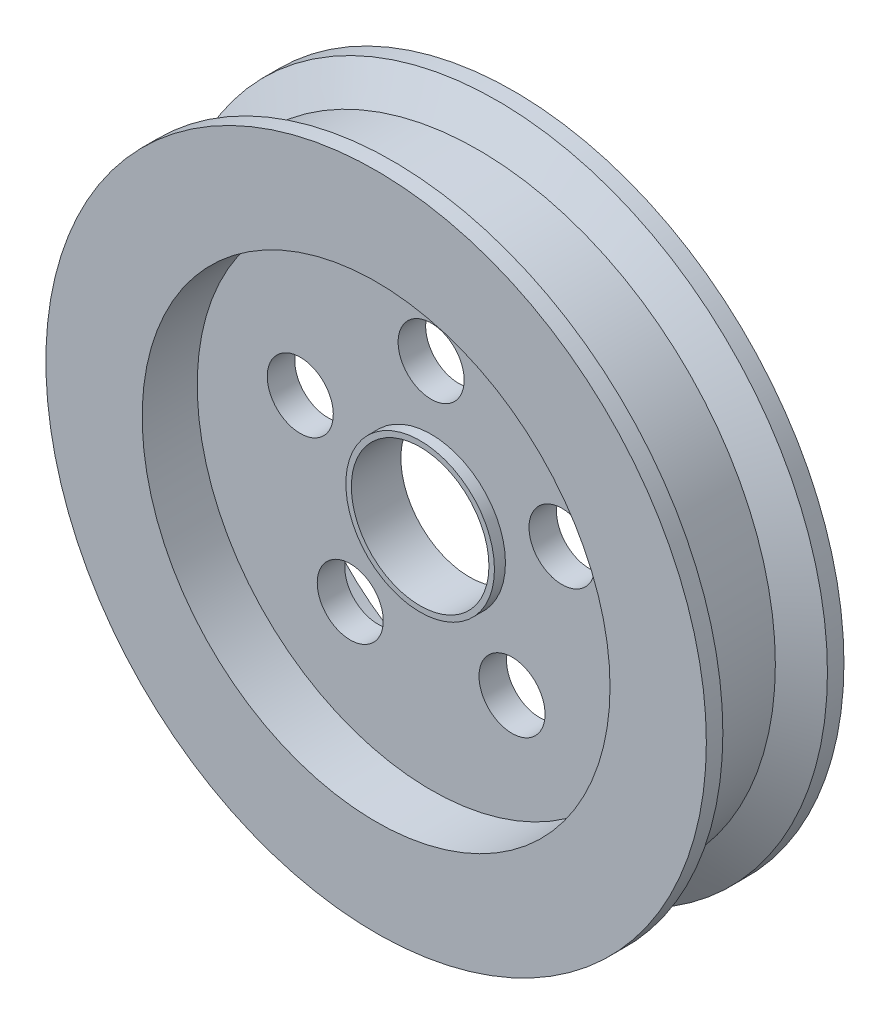
ISO-10303-21;
HEADER;
FILE_DESCRIPTION(('STEP AP214'),'2;1');
FILE_NAME('part.step','',(''),(''),'','','');
FILE_SCHEMA(('AUTOMOTIVE_DESIGN { 1 0 10303 214 1 1 1 1 }'));
ENDSEC;
DATA;
#1=APPLICATION_CONTEXT('core data for automotive mechanical design processes');
#2=APPLICATION_PROTOCOL_DEFINITION('international standard','automotive_design',2000,#1);
#3=PRODUCT_CONTEXT('',#1,'mechanical');
#4=PRODUCT('Part','Part','',(#3));
#5=PRODUCT_RELATED_PRODUCT_CATEGORY('part','',(#4));
#6=PRODUCT_DEFINITION_FORMATION('','',#4);
#7=PRODUCT_DEFINITION_CONTEXT('part definition',#1,'design');
#8=PRODUCT_DEFINITION('design','',#6,#7);
#9=PRODUCT_DEFINITION_SHAPE('','',#8);
#10=(LENGTH_UNIT() NAMED_UNIT(*) SI_UNIT(.MILLI.,.METRE.));
#11=(NAMED_UNIT(*) PLANE_ANGLE_UNIT() SI_UNIT($,.RADIAN.));
#12=(NAMED_UNIT(*) SI_UNIT($,.STERADIAN.) SOLID_ANGLE_UNIT());
#13=UNCERTAINTY_MEASURE_WITH_UNIT(LENGTH_MEASURE(1.E-05),#10,'distance_accuracy_value','');
#14=(GEOMETRIC_REPRESENTATION_CONTEXT(3) GLOBAL_UNCERTAINTY_ASSIGNED_CONTEXT((#13)) GLOBAL_UNIT_ASSIGNED_CONTEXT((#10,
#11,#12)) REPRESENTATION_CONTEXT('',''));
#15=CARTESIAN_POINT('',(0.,0.,0.));
#16=DIRECTION('',(0.,0.,1.));
#17=DIRECTION('',(1.,0.,0.));
#18=AXIS2_PLACEMENT_3D('',#15,#16,#17);
#19=CARTESIAN_POINT('',(0.,0.,12.5));
#20=DIRECTION('',(0.,0.,-1.));
#21=DIRECTION('',(-1.,0.,0.));
#22=AXIS2_PLACEMENT_3D('',#19,#20,#21);
#23=CYLINDRICAL_SURFACE('',#22,60.);
#24=CARTESIAN_POINT('',(0.,0.,-9.5));
#25=DIRECTION('',(0.,0.,1.));
#26=DIRECTION('',(1.,0.,0.));
#27=AXIS2_PLACEMENT_3D('',#24,#25,#26);
#28=CIRCLE('',#27,60.);
#29=CARTESIAN_POINT('',(60.,0.,-9.5));
#30=VERTEX_POINT('',#29);
#31=EDGE_CURVE('E72',#30,#30,#28,.T.);
#32=ORIENTED_EDGE('',*,*,#31,.F.);
#33=EDGE_LOOP('',(#32));
#34=FACE_BOUND('',#33,.T.);
#35=CARTESIAN_POINT('',(0.,0.,-12.5));
#36=DIRECTION('',(0.,0.,1.));
#37=DIRECTION('',(1.,0.,0.));
#38=AXIS2_PLACEMENT_3D('',#35,#36,#37);
#39=CIRCLE('',#38,60.);
#40=CARTESIAN_POINT('',(60.,0.,-12.5));
#41=VERTEX_POINT('',#40);
#42=EDGE_CURVE('E112',#41,#41,#39,.T.);
#43=ORIENTED_EDGE('',*,*,#42,.T.);
#44=EDGE_LOOP('',(#43));
#45=FACE_BOUND('',#44,.T.);
#46=ADVANCED_FACE('F41',(#34,#45),#23,.T.);
#47=CARTESIAN_POINT('',(0.,0.,12.5));
#48=DIRECTION('',(0.,0.,1.));
#49=DIRECTION('',(1.,0.,0.));
#50=AXIS2_PLACEMENT_3D('',#47,#48,#49);
#51=PLANE('',#50);
#52=CARTESIAN_POINT('',(0.,0.,12.5));
#53=DIRECTION('',(0.,0.,1.));
#54=DIRECTION('',(1.,0.,0.));
#55=AXIS2_PLACEMENT_3D('',#52,#53,#54);
#56=CIRCLE('',#55,42.5);
#57=CARTESIAN_POINT('',(42.5,0.,12.5));
#58=VERTEX_POINT('',#57);
#59=EDGE_CURVE('E103',#58,#58,#56,.T.);
#60=ORIENTED_EDGE('',*,*,#59,.F.);
#61=EDGE_LOOP('',(#60));
#62=FACE_BOUND('',#61,.T.);
#63=CARTESIAN_POINT('',(0.,0.,12.5));
#64=DIRECTION('',(0.,0.,1.));
#65=DIRECTION('',(1.,0.,0.));
#66=AXIS2_PLACEMENT_3D('',#63,#64,#65);
#67=CIRCLE('',#66,60.);
#68=CARTESIAN_POINT('',(60.,0.,12.5));
#69=VERTEX_POINT('',#68);
#70=EDGE_CURVE('E55',#69,#69,#67,.T.);
#71=ORIENTED_EDGE('',*,*,#70,.T.);
#72=EDGE_LOOP('',(#71));
#73=FACE_BOUND('',#72,.T.);
#74=ADVANCED_FACE('F168',(#62,#73),#51,.T.);
#75=CARTESIAN_POINT('',(0.,0.,-12.5));
#76=DIRECTION('',(0.,0.,1.));
#77=DIRECTION('',(1.,0.,0.));
#78=AXIS2_PLACEMENT_3D('',#75,#76,#77);
#79=PLANE('',#78);
#80=CARTESIAN_POINT('',(0.,0.,-12.5));
#81=DIRECTION('',(0.,0.,1.));
#82=DIRECTION('',(1.,0.,0.));
#83=AXIS2_PLACEMENT_3D('',#80,#81,#82);
#84=CIRCLE('',#83,42.5);
#85=CARTESIAN_POINT('',(42.5,0.,-12.5));
#86=VERTEX_POINT('',#85);
#87=EDGE_CURVE('E104',#86,#86,#84,.T.);
#88=ORIENTED_EDGE('',*,*,#87,.T.);
#89=EDGE_LOOP('',(#88));
#90=FACE_BOUND('',#89,.T.);
#91=ORIENTED_EDGE('',*,*,#42,.F.);
#92=EDGE_LOOP('',(#91));
#93=FACE_BOUND('',#92,.T.);
#94=ADVANCED_FACE('F165',(#90,#93),#79,.F.);
#95=CARTESIAN_POINT('',(0.,0.,9.5));
#96=DIRECTION('',(0.,0.,1.));
#97=DIRECTION('',(1.,0.,0.));
#98=AXIS2_PLACEMENT_3D('',#95,#96,#97);
#99=CIRCLE('',#98,60.);
#100=CARTESIAN_POINT('',(60.,0.,9.5));
#101=VERTEX_POINT('',#100);
#102=EDGE_CURVE('E60',#101,#101,#99,.T.);
#103=ORIENTED_EDGE('',*,*,#102,.T.);
#104=EDGE_LOOP('',(#103));
#105=FACE_BOUND('',#104,.T.);
#106=ORIENTED_EDGE('',*,*,#70,.F.);
#107=EDGE_LOOP('',(#106));
#108=FACE_BOUND('',#107,.T.);
#109=ADVANCED_FACE('F43',(#105,#108),#23,.T.);
#110=CARTESIAN_POINT('',(0.,0.,2.5));
#111=DIRECTION('',(0.,0.,1.));
#112=DIRECTION('',(1.,0.,0.));
#113=AXIS2_PLACEMENT_3D('',#110,#111,#112);
#114=CYLINDRICAL_SURFACE('',#113,42.5);
#115=CARTESIAN_POINT('',(0.,0.,2.5));
#116=DIRECTION('',(0.,0.,1.));
#117=DIRECTION('',(1.,0.,0.));
#118=AXIS2_PLACEMENT_3D('',#115,#116,#117);
#119=CIRCLE('',#118,42.5);
#120=CARTESIAN_POINT('',(42.5,0.,2.5));
#121=VERTEX_POINT('',#120);
#122=EDGE_CURVE('E108',#121,#121,#119,.T.);
#123=ORIENTED_EDGE('',*,*,#122,.F.);
#124=EDGE_LOOP('',(#123));
#125=FACE_BOUND('',#124,.T.);
#126=ORIENTED_EDGE('',*,*,#59,.T.);
#127=EDGE_LOOP('',(#126));
#128=FACE_BOUND('',#127,.T.);
#129=ADVANCED_FACE('F180',(#125,#128),#114,.F.);
#130=CARTESIAN_POINT('',(0.,0.,2.5));
#131=DIRECTION('',(0.,0.,1.));
#132=DIRECTION('',(1.,0.,0.));
#133=AXIS2_PLACEMENT_3D('',#130,#131,#132);
#134=PLANE('',#133);
#135=CARTESIAN_POINT('',(0.,0.,2.5));
#136=DIRECTION('',(0.,0.,1.));
#137=DIRECTION('',(1.,0.,0.));
#138=AXIS2_PLACEMENT_3D('',#135,#136,#137);
#139=CIRCLE('',#138,13.5);
#140=CARTESIAN_POINT('',(13.5,0.,2.5));
#141=VERTEX_POINT('',#140);
#142=EDGE_CURVE('E10',#141,#141,#139,.T.);
#143=ORIENTED_EDGE('',*,*,#142,.F.);
#144=EDGE_LOOP('',(#143));
#145=FACE_BOUND('',#144,.T.);
#146=CARTESIAN_POINT('',(23.7764129073788,7.72542485937396,2.5));
#147=DIRECTION('',(0.,0.,1.));
#148=DIRECTION('',(0.309016994374958,-0.95105651629515,0.));
#149=AXIS2_PLACEMENT_3D('',#146,#147,#148);
#150=CIRCLE('',#149,6.);
#151=CARTESIAN_POINT('',(25.6305148736285,2.01908576160305,2.5));
#152=VERTEX_POINT('',#151);
#153=EDGE_CURVE('E76',#152,#152,#150,.T.);
#154=ORIENTED_EDGE('',*,*,#153,.F.);
#155=EDGE_LOOP('',(#154));
#156=FACE_BOUND('',#155,.T.);
#157=CARTESIAN_POINT('',(14.694631307312,-20.2254248593736,2.5));
#158=DIRECTION('',(0.,0.,1.));
#159=DIRECTION('',(-0.809016994374942,-0.58778525229248,0.));
#160=AXIS2_PLACEMENT_3D('',#157,#158,#159);
#161=CIRCLE('',#160,6.);
#162=CARTESIAN_POINT('',(9.84052934106235,-23.7521363731284,2.5));
#163=VERTEX_POINT('',#162);
#164=EDGE_CURVE('E82',#163,#163,#161,.T.);
#165=ORIENTED_EDGE('',*,*,#164,.F.);
#166=EDGE_LOOP('',(#165));
#167=FACE_BOUND('',#166,.T.);
#168=CARTESIAN_POINT('',(-14.6946313073117,-20.2254248593738,2.5));
#169=DIRECTION('',(0.,0.,1.));
#170=DIRECTION('',(-0.809016994374951,0.587785252292469,0.));
#171=AXIS2_PLACEMENT_3D('',#168,#169,#170);
#172=CIRCLE('',#171,6.);
#173=CARTESIAN_POINT('',(-19.5487332735614,-16.698713345619,2.5));
#174=VERTEX_POINT('',#173);
#175=EDGE_CURVE('E77',#174,#174,#172,.T.);
#176=ORIENTED_EDGE('',*,*,#175,.F.);
#177=EDGE_LOOP('',(#176));
#178=FACE_BOUND('',#177,.T.);
#179=CARTESIAN_POINT('',(-23.7764129073789,7.72542485937362,2.5));
#180=DIRECTION('',(0.,0.,1.));
#181=DIRECTION('',(0.309016994374945,0.951056516295155,0.));
#182=AXIS2_PLACEMENT_3D('',#179,#180,#181);
#183=CIRCLE('',#182,6.);
#184=CARTESIAN_POINT('',(-21.9223109411292,13.4317639571445,2.5));
#185=VERTEX_POINT('',#184);
#186=EDGE_CURVE('E81',#185,#185,#183,.T.);
#187=ORIENTED_EDGE('',*,*,#186,.F.);
#188=EDGE_LOOP('',(#187));
#189=FACE_BOUND('',#188,.T.);
#190=CARTESIAN_POINT('',(0.,25.,2.5));
#191=DIRECTION('',(0.,0.,1.));
#192=DIRECTION('',(1.,0.,0.));
#193=AXIS2_PLACEMENT_3D('',#190,#191,#192);
#194=CIRCLE('',#193,6.);
#195=CARTESIAN_POINT('',(6.,25.,2.5));
#196=VERTEX_POINT('',#195);
#197=EDGE_CURVE('E93',#196,#196,#194,.T.);
#198=ORIENTED_EDGE('',*,*,#197,.F.);
#199=EDGE_LOOP('',(#198));
#200=FACE_BOUND('',#199,.T.);
#201=ORIENTED_EDGE('',*,*,#122,.T.);
#202=EDGE_LOOP('',(#201));
#203=FACE_BOUND('',#202,.T.);
#204=ADVANCED_FACE('F161',(#145,#156,#167,#178,#189,#200,#203),#134,.T.);
#205=CARTESIAN_POINT('',(0.,0.,-2.5));
#206=DIRECTION('',(0.,0.,-1.));
#207=DIRECTION('',(-1.,0.,0.));
#208=AXIS2_PLACEMENT_3D('',#205,#206,#207);
#209=CYLINDRICAL_SURFACE('',#208,42.5);
#210=CARTESIAN_POINT('',(0.,0.,-2.5));
#211=DIRECTION('',(0.,0.,1.));
#212=DIRECTION('',(1.,0.,0.));
#213=AXIS2_PLACEMENT_3D('',#210,#211,#212);
#214=CIRCLE('',#213,42.5);
#215=CARTESIAN_POINT('',(42.5,0.,-2.5));
#216=VERTEX_POINT('',#215);
#217=EDGE_CURVE('E99',#216,#216,#214,.T.);
#218=ORIENTED_EDGE('',*,*,#217,.T.);
#219=EDGE_LOOP('',(#218));
#220=FACE_BOUND('',#219,.T.);
#221=ORIENTED_EDGE('',*,*,#87,.F.);
#222=EDGE_LOOP('',(#221));
#223=FACE_BOUND('',#222,.T.);
#224=ADVANCED_FACE('F146',(#220,#223),#209,.F.);
#225=CARTESIAN_POINT('',(0.,0.,-2.5));
#226=DIRECTION('',(0.,0.,-1.));
#227=DIRECTION('',(1.,0.,0.));
#228=AXIS2_PLACEMENT_3D('',#225,#226,#227);
#229=PLANE('',#228);
#230=CARTESIAN_POINT('',(0.,0.,-2.5));
#231=DIRECTION('',(0.,0.,-1.));
#232=DIRECTION('',(-1.,0.,0.));
#233=AXIS2_PLACEMENT_3D('',#230,#231,#232);
#234=CIRCLE('',#233,13.5);
#235=CARTESIAN_POINT('',(-13.5,0.,-2.5));
#236=VERTEX_POINT('',#235);
#237=EDGE_CURVE('E45',#236,#236,#234,.T.);
#238=ORIENTED_EDGE('',*,*,#237,.F.);
#239=EDGE_LOOP('',(#238));
#240=FACE_BOUND('',#239,.T.);
#241=CARTESIAN_POINT('',(23.7764129073788,7.72542485937396,-2.5));
#242=DIRECTION('',(0.,0.,-1.));
#243=DIRECTION('',(-1.,0.,0.));
#244=AXIS2_PLACEMENT_3D('',#241,#242,#243);
#245=CIRCLE('',#244,6.);
#246=CARTESIAN_POINT('',(17.7764129073787,7.72542485937396,-2.5));
#247=VERTEX_POINT('',#246);
#248=EDGE_CURVE('E98',#247,#247,#245,.T.);
#249=ORIENTED_EDGE('',*,*,#248,.F.);
#250=EDGE_LOOP('',(#249));
#251=FACE_BOUND('',#250,.T.);
#252=CARTESIAN_POINT('',(14.694631307312,-20.2254248593736,-2.5));
#253=DIRECTION('',(0.,0.,-1.));
#254=DIRECTION('',(-1.,0.,0.));
#255=AXIS2_PLACEMENT_3D('',#252,#253,#254);
#256=CIRCLE('',#255,6.);
#257=CARTESIAN_POINT('',(8.69463130731201,-20.2254248593736,-2.5));
#258=VERTEX_POINT('',#257);
#259=EDGE_CURVE('E132',#258,#258,#256,.T.);
#260=ORIENTED_EDGE('',*,*,#259,.F.);
#261=EDGE_LOOP('',(#260));
#262=FACE_BOUND('',#261,.T.);
#263=CARTESIAN_POINT('',(-14.6946313073117,-20.2254248593738,-2.5));
#264=DIRECTION('',(0.,0.,-1.));
#265=DIRECTION('',(-1.,0.,0.));
#266=AXIS2_PLACEMENT_3D('',#263,#264,#265);
#267=CIRCLE('',#266,6.);
#268=CARTESIAN_POINT('',(-20.6946313073117,-20.2254248593738,-2.5));
#269=VERTEX_POINT('',#268);
#270=EDGE_CURVE('E128',#269,#269,#267,.T.);
#271=ORIENTED_EDGE('',*,*,#270,.F.);
#272=EDGE_LOOP('',(#271));
#273=FACE_BOUND('',#272,.T.);
#274=CARTESIAN_POINT('',(-23.7764129073789,7.72542485937362,-2.5));
#275=DIRECTION('',(0.,0.,-1.));
#276=DIRECTION('',(-1.,0.,0.));
#277=AXIS2_PLACEMENT_3D('',#274,#275,#276);
#278=CIRCLE('',#277,6.);
#279=CARTESIAN_POINT('',(-29.7764129073789,7.72542485937362,-2.5));
#280=VERTEX_POINT('',#279);
#281=EDGE_CURVE('E92',#280,#280,#278,.T.);
#282=ORIENTED_EDGE('',*,*,#281,.F.);
#283=EDGE_LOOP('',(#282));
#284=FACE_BOUND('',#283,.T.);
#285=CARTESIAN_POINT('',(0.,25.,-2.5));
#286=DIRECTION('',(0.,0.,-1.));
#287=DIRECTION('',(-1.,0.,0.));
#288=AXIS2_PLACEMENT_3D('',#285,#286,#287);
#289=CIRCLE('',#288,6.);
#290=CARTESIAN_POINT('',(-6.,25.,-2.5));
#291=VERTEX_POINT('',#290);
#292=EDGE_CURVE('E97',#291,#291,#289,.T.);
#293=ORIENTED_EDGE('',*,*,#292,.F.);
#294=EDGE_LOOP('',(#293));
#295=FACE_BOUND('',#294,.T.);
#296=ORIENTED_EDGE('',*,*,#217,.F.);
#297=EDGE_LOOP('',(#296));
#298=FACE_BOUND('',#297,.T.);
#299=ADVANCED_FACE('F142',(#240,#251,#262,#273,#284,#295,#298),#229,.T.);
#300=CARTESIAN_POINT('',(0.,25.,-12.5));
#301=DIRECTION('',(0.,0.,1.));
#302=DIRECTION('',(1.,0.,0.));
#303=AXIS2_PLACEMENT_3D('',#300,#301,#302);
#304=CYLINDRICAL_SURFACE('',#303,6.);
#305=ORIENTED_EDGE('',*,*,#292,.T.);
#306=EDGE_LOOP('',(#305));
#307=FACE_BOUND('',#306,.T.);
#308=ORIENTED_EDGE('',*,*,#197,.T.);
#309=EDGE_LOOP('',(#308));
#310=FACE_BOUND('',#309,.T.);
#311=ADVANCED_FACE('F145',(#307,#310),#304,.F.);
#312=CARTESIAN_POINT('',(-23.7764129073789,7.72542485937362,-12.5));
#313=DIRECTION('',(0.,0.,1.));
#314=DIRECTION('',(1.,0.,0.));
#315=AXIS2_PLACEMENT_3D('',#312,#313,#314);
#316=CYLINDRICAL_SURFACE('',#315,6.);
#317=ORIENTED_EDGE('',*,*,#281,.T.);
#318=EDGE_LOOP('',(#317));
#319=FACE_BOUND('',#318,.T.);
#320=ORIENTED_EDGE('',*,*,#186,.T.);
#321=EDGE_LOOP('',(#320));
#322=FACE_BOUND('',#321,.T.);
#323=ADVANCED_FACE('F218',(#319,#322),#316,.F.);
#324=CARTESIAN_POINT('',(-14.6946313073117,-20.2254248593738,-12.5));
#325=DIRECTION('',(0.,0.,1.));
#326=DIRECTION('',(1.,0.,0.));
#327=AXIS2_PLACEMENT_3D('',#324,#325,#326);
#328=CYLINDRICAL_SURFACE('',#327,6.);
#329=ORIENTED_EDGE('',*,*,#270,.T.);
#330=EDGE_LOOP('',(#329));
#331=FACE_BOUND('',#330,.T.);
#332=ORIENTED_EDGE('',*,*,#175,.T.);
#333=EDGE_LOOP('',(#332));
#334=FACE_BOUND('',#333,.T.);
#335=ADVANCED_FACE('F215',(#331,#334),#328,.F.);
#336=CARTESIAN_POINT('',(14.694631307312,-20.2254248593736,-12.5));
#337=DIRECTION('',(0.,0.,1.));
#338=DIRECTION('',(1.,0.,0.));
#339=AXIS2_PLACEMENT_3D('',#336,#337,#338);
#340=CYLINDRICAL_SURFACE('',#339,6.);
#341=ORIENTED_EDGE('',*,*,#259,.T.);
#342=EDGE_LOOP('',(#341));
#343=FACE_BOUND('',#342,.T.);
#344=ORIENTED_EDGE('',*,*,#164,.T.);
#345=EDGE_LOOP('',(#344));
#346=FACE_BOUND('',#345,.T.);
#347=ADVANCED_FACE('F212',(#343,#346),#340,.F.);
#348=CARTESIAN_POINT('',(23.7764129073788,7.72542485937396,-12.5));
#349=DIRECTION('',(0.,0.,1.));
#350=DIRECTION('',(1.,0.,0.));
#351=AXIS2_PLACEMENT_3D('',#348,#349,#350);
#352=CYLINDRICAL_SURFACE('',#351,6.);
#353=ORIENTED_EDGE('',*,*,#248,.T.);
#354=EDGE_LOOP('',(#353));
#355=FACE_BOUND('',#354,.T.);
#356=ORIENTED_EDGE('',*,*,#153,.T.);
#357=EDGE_LOOP('',(#356));
#358=FACE_BOUND('',#357,.T.);
#359=ADVANCED_FACE('F139',(#355,#358),#352,.F.);
#360=CARTESIAN_POINT('',(0.,0.,-9.5));
#361=DIRECTION('',(0.,0.,-1.));
#362=DIRECTION('',(-1.,0.,0.));
#363=AXIS2_PLACEMENT_3D('',#360,#361,#362);
#364=CONICAL_SURFACE('',#363,60.,1.04719755119659);
#365=CARTESIAN_POINT('',(0.,0.,-6.03589838486223));
#366=DIRECTION('',(0.,0.,1.));
#367=DIRECTION('',(1.,0.,0.));
#368=AXIS2_PLACEMENT_3D('',#365,#366,#367);
#369=CIRCLE('',#368,54.);
#370=CARTESIAN_POINT('',(54.,0.,-6.03589838486223));
#371=VERTEX_POINT('',#370);
#372=EDGE_CURVE('E68',#371,#371,#369,.T.);
#373=ORIENTED_EDGE('',*,*,#372,.F.);
#374=EDGE_LOOP('',(#373));
#375=FACE_BOUND('',#374,.T.);
#376=ORIENTED_EDGE('',*,*,#31,.T.);
#377=EDGE_LOOP('',(#376));
#378=FACE_BOUND('',#377,.T.);
#379=ADVANCED_FACE('F202',(#375,#378),#364,.T.);
#380=CARTESIAN_POINT('',(0.,0.,0.));
#381=DIRECTION('',(0.,0.,1.));
#382=DIRECTION('',(1.,0.,0.));
#383=AXIS2_PLACEMENT_3D('',#380,#381,#382);
#384=CYLINDRICAL_SURFACE('',#383,54.);
#385=CARTESIAN_POINT('',(0.,0.,6.03589838486228));
#386=DIRECTION('',(0.,0.,1.));
#387=DIRECTION('',(1.,0.,0.));
#388=AXIS2_PLACEMENT_3D('',#385,#386,#387);
#389=CIRCLE('',#388,54.);
#390=CARTESIAN_POINT('',(54.,0.,6.03589838486228));
#391=VERTEX_POINT('',#390);
#392=EDGE_CURVE('E64',#391,#391,#389,.T.);
#393=ORIENTED_EDGE('',*,*,#392,.F.);
#394=EDGE_LOOP('',(#393));
#395=FACE_BOUND('',#394,.T.);
#396=ORIENTED_EDGE('',*,*,#372,.T.);
#397=EDGE_LOOP('',(#396));
#398=FACE_BOUND('',#397,.T.);
#399=ADVANCED_FACE('F196',(#395,#398),#384,.T.);
#400=CARTESIAN_POINT('',(0.,0.,6.03589838486228));
#401=DIRECTION('',(0.,0.,1.));
#402=DIRECTION('',(1.,0.,0.));
#403=AXIS2_PLACEMENT_3D('',#400,#401,#402);
#404=CONICAL_SURFACE('',#403,54.,1.0471975511966);
#405=ORIENTED_EDGE('',*,*,#102,.F.);
#406=EDGE_LOOP('',(#405));
#407=FACE_BOUND('',#406,.T.);
#408=ORIENTED_EDGE('',*,*,#392,.T.);
#409=EDGE_LOOP('',(#408));
#410=FACE_BOUND('',#409,.T.);
#411=ADVANCED_FACE('F192',(#407,#410),#404,.T.);
#412=CARTESIAN_POINT('',(0.,0.,-4.5));
#413=DIRECTION('',(0.,0.,1.));
#414=DIRECTION('',(1.,0.,0.));
#415=AXIS2_PLACEMENT_3D('',#412,#413,#414);
#416=CYLINDRICAL_SURFACE('',#415,13.5);
#417=ORIENTED_EDGE('',*,*,#237,.T.);
#418=EDGE_LOOP('',(#417));
#419=FACE_BOUND('',#418,.T.);
#420=CARTESIAN_POINT('',(0.,0.,-4.5));
#421=DIRECTION('',(0.,0.,1.));
#422=DIRECTION('',(1.,0.,0.));
#423=AXIS2_PLACEMENT_3D('',#420,#421,#422);
#424=CIRCLE('',#423,13.5);
#425=CARTESIAN_POINT('',(13.5,0.,-4.5));
#426=VERTEX_POINT('',#425);
#427=EDGE_CURVE('E58',#426,#426,#424,.T.);
#428=ORIENTED_EDGE('',*,*,#427,.T.);
#429=EDGE_LOOP('',(#428));
#430=FACE_BOUND('',#429,.T.);
#431=ADVANCED_FACE('F195',(#419,#430),#416,.T.);
#432=CARTESIAN_POINT('',(0.,0.,-4.5));
#433=DIRECTION('',(0.,0.,1.));
#434=DIRECTION('',(1.,0.,0.));
#435=AXIS2_PLACEMENT_3D('',#432,#433,#434);
#436=PLANE('',#435);
#437=CARTESIAN_POINT('',(0.,0.,-4.5));
#438=DIRECTION('',(0.,0.,1.));
#439=DIRECTION('',(1.,0.,0.));
#440=AXIS2_PLACEMENT_3D('',#437,#438,#439);
#441=CIRCLE('',#440,12.5);
#442=CARTESIAN_POINT('',(12.5,0.,-4.5));
#443=VERTEX_POINT('',#442);
#444=EDGE_CURVE('E245',#443,#443,#441,.T.);
#445=ORIENTED_EDGE('',*,*,#444,.T.);
#446=EDGE_LOOP('',(#445));
#447=FACE_BOUND('',#446,.T.);
#448=ORIENTED_EDGE('',*,*,#427,.F.);
#449=EDGE_LOOP('',(#448));
#450=FACE_BOUND('',#449,.T.);
#451=ADVANCED_FACE('F263',(#447,#450),#436,.F.);
#452=ORIENTED_EDGE('',*,*,#142,.T.);
#453=EDGE_LOOP('',(#452));
#454=FACE_BOUND('',#453,.T.);
#455=CARTESIAN_POINT('',(0.,0.,4.5));
#456=DIRECTION('',(0.,0.,1.));
#457=DIRECTION('',(1.,0.,0.));
#458=AXIS2_PLACEMENT_3D('',#455,#456,#457);
#459=CIRCLE('',#458,13.5);
#460=CARTESIAN_POINT('',(13.5,0.,4.5));
#461=VERTEX_POINT('',#460);
#462=EDGE_CURVE('E251',#461,#461,#459,.T.);
#463=ORIENTED_EDGE('',*,*,#462,.F.);
#464=EDGE_LOOP('',(#463));
#465=FACE_BOUND('',#464,.T.);
#466=ADVANCED_FACE('F239',(#454,#465),#416,.T.);
#467=CARTESIAN_POINT('',(0.,0.,4.5));
#468=DIRECTION('',(0.,0.,1.));
#469=DIRECTION('',(1.,0.,0.));
#470=AXIS2_PLACEMENT_3D('',#467,#468,#469);
#471=PLANE('',#470);
#472=ORIENTED_EDGE('',*,*,#462,.T.);
#473=EDGE_LOOP('',(#472));
#474=FACE_BOUND('',#473,.T.);
#475=CARTESIAN_POINT('',(0.,0.,4.5));
#476=DIRECTION('',(0.,0.,1.));
#477=DIRECTION('',(1.,0.,0.));
#478=AXIS2_PLACEMENT_3D('',#475,#476,#477);
#479=CIRCLE('',#478,12.5);
#480=CARTESIAN_POINT('',(12.5,0.,4.5));
#481=VERTEX_POINT('',#480);
#482=EDGE_CURVE('E248',#481,#481,#479,.T.);
#483=ORIENTED_EDGE('',*,*,#482,.F.);
#484=EDGE_LOOP('',(#483));
#485=FACE_BOUND('',#484,.T.);
#486=ADVANCED_FACE('F234',(#474,#485),#471,.T.);
#487=CARTESIAN_POINT('',(0.,0.,12.5));
#488=DIRECTION('',(0.,0.,-1.));
#489=DIRECTION('',(-1.,0.,0.));
#490=AXIS2_PLACEMENT_3D('',#487,#488,#489);
#491=CYLINDRICAL_SURFACE('',#490,12.5);
#492=ORIENTED_EDGE('',*,*,#444,.F.);
#493=EDGE_LOOP('',(#492));
#494=FACE_BOUND('',#493,.T.);
#495=ORIENTED_EDGE('',*,*,#482,.T.);
#496=EDGE_LOOP('',(#495));
#497=FACE_BOUND('',#496,.T.);
#498=ADVANCED_FACE('F232',(#494,#497),#491,.F.);
#499=CLOSED_SHELL('',(#46,#74,#94,#109,#129,#204,#224,#299,#311,#323,#335,#347,#359,#379,#399,
#411,#431,#451,#466,#486,#498));
#500=MANIFOLD_SOLID_BREP('B2',#499);
#501=ADVANCED_BREP_SHAPE_REPRESENTATION('',(#18,#500),#14);
#502=SHAPE_DEFINITION_REPRESENTATION(#9,#501);
ENDSEC;
END-ISO-10303-21;
